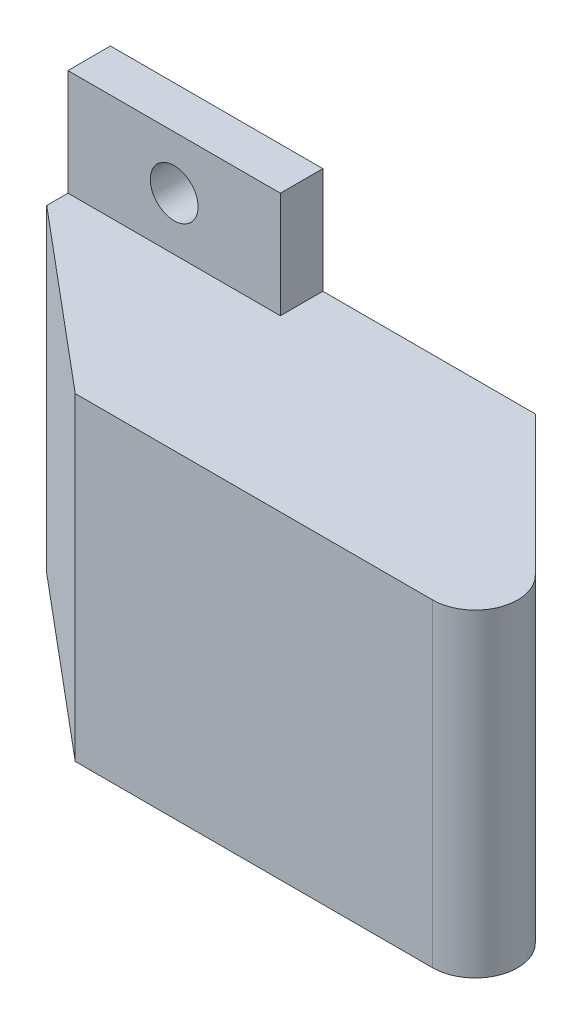
ISO-10303-21;
HEADER;
FILE_DESCRIPTION(('STEP AP214'),'2;1');
FILE_NAME('part.step','',(''),(''),'','','');
FILE_SCHEMA(('AUTOMOTIVE_DESIGN { 1 0 10303 214 1 1 1 1 }'));
ENDSEC;
DATA;
#1=APPLICATION_CONTEXT('core data for automotive mechanical design processes');
#2=APPLICATION_PROTOCOL_DEFINITION('international standard','automotive_design',2000,#1);
#3=PRODUCT_CONTEXT('',#1,'mechanical');
#4=PRODUCT('Part','Part','',(#3));
#5=PRODUCT_RELATED_PRODUCT_CATEGORY('part','',(#4));
#6=PRODUCT_DEFINITION_FORMATION('','',#4);
#7=PRODUCT_DEFINITION_CONTEXT('part definition',#1,'design');
#8=PRODUCT_DEFINITION('design','',#6,#7);
#9=PRODUCT_DEFINITION_SHAPE('','',#8);
#10=(LENGTH_UNIT() NAMED_UNIT(*) SI_UNIT(.MILLI.,.METRE.));
#11=(NAMED_UNIT(*) PLANE_ANGLE_UNIT() SI_UNIT($,.RADIAN.));
#12=(NAMED_UNIT(*) SI_UNIT($,.STERADIAN.) SOLID_ANGLE_UNIT());
#13=UNCERTAINTY_MEASURE_WITH_UNIT(LENGTH_MEASURE(1.E-05),#10,'distance_accuracy_value','');
#14=(GEOMETRIC_REPRESENTATION_CONTEXT(3) GLOBAL_UNCERTAINTY_ASSIGNED_CONTEXT((#13)) GLOBAL_UNIT_ASSIGNED_CONTEXT((#10,
#11,#12)) REPRESENTATION_CONTEXT('',''));
#15=CARTESIAN_POINT('',(0.,0.,0.));
#16=DIRECTION('',(0.,0.,1.));
#17=DIRECTION('',(1.,0.,0.));
#18=AXIS2_PLACEMENT_3D('',#15,#16,#17);
#19=CARTESIAN_POINT('',(60.,0.,0.));
#20=DIRECTION('',(0.,0.,-1.));
#21=DIRECTION('',(-1.,0.,0.));
#22=AXIS2_PLACEMENT_3D('',#19,#20,#21);
#23=PLANE('',#22);
#24=DIRECTION('',(-1.,0.,0.));
#25=VECTOR('',#24,1.);
#26=CARTESIAN_POINT('',(60.,30.,0.));
#27=LINE('',#26,#25);
#28=CARTESIAN_POINT('',(50.3431457505078,30.,0.));
#29=VERTEX_POINT('',#28);
#30=CARTESIAN_POINT('',(16.6845502963189,30.,0.));
#31=VERTEX_POINT('',#30);
#32=EDGE_CURVE('E298',#29,#31,#27,.T.);
#33=ORIENTED_EDGE('',*,*,#32,.T.);
#34=DIRECTION('',(0.,-1.,0.));
#35=VECTOR('',#34,1.);
#36=CARTESIAN_POINT('',(16.6845502963189,0.,0.));
#37=LINE('',#36,#35);
#38=CARTESIAN_POINT('',(16.6845502963189,0.,0.));
#39=VERTEX_POINT('',#38);
#40=EDGE_CURVE('E327',#31,#39,#37,.T.);
#41=ORIENTED_EDGE('',*,*,#40,.T.);
#42=DIRECTION('',(-1.,0.,0.));
#43=VECTOR('',#42,1.);
#44=CARTESIAN_POINT('',(60.,0.,0.));
#45=LINE('',#44,#43);
#46=CARTESIAN_POINT('',(50.3431457505078,0.,0.));
#47=VERTEX_POINT('',#46);
#48=EDGE_CURVE('E308',#47,#39,#45,.T.);
#49=ORIENTED_EDGE('',*,*,#48,.F.);
#50=DIRECTION('',(0.,-1.,0.));
#51=VECTOR('',#50,1.);
#52=CARTESIAN_POINT('',(50.3431457505078,0.,0.));
#53=LINE('',#52,#51);
#54=EDGE_CURVE('E321',#47,#29,#53,.F.);
#55=ORIENTED_EDGE('',*,*,#54,.T.);
#56=EDGE_LOOP('',(#33,#41,#49,#55));
#57=FACE_BOUND('',#56,.T.);
#58=ADVANCED_FACE('F38',(#57),#23,.F.);
#59=CARTESIAN_POINT('',(60.,0.,0.));
#60=DIRECTION('',(0.,1.,0.));
#61=DIRECTION('',(0.,0.,1.));
#62=AXIS2_PLACEMENT_3D('',#59,#60,#61);
#63=PLANE('',#62);
#64=ORIENTED_EDGE('',*,*,#48,.T.);
#65=DIRECTION('',(-0.766044443118977,0.,-0.64278760968654));
#66=VECTOR('',#65,1.);
#67=CARTESIAN_POINT('',(16.6845502963189,0.,0.));
#68=LINE('',#67,#66);
#69=CARTESIAN_POINT('',(0.,0.,-14.));
#70=VERTEX_POINT('',#69);
#71=EDGE_CURVE('E61',#39,#70,#68,.T.);
#72=ORIENTED_EDGE('',*,*,#71,.T.);
#73=DIRECTION('',(0.,0.,-1.));
#74=VECTOR('',#73,1.);
#75=CARTESIAN_POINT('',(0.,0.,0.));
#76=LINE('',#75,#74);
#77=CARTESIAN_POINT('',(0.,0.,-16.));
#78=VERTEX_POINT('',#77);
#79=EDGE_CURVE('E289',#70,#78,#76,.T.);
#80=ORIENTED_EDGE('',*,*,#79,.T.);
#81=DIRECTION('',(1.,0.,0.));
#82=VECTOR('',#81,1.);
#83=CARTESIAN_POINT('',(60.,0.,-16.));
#84=LINE('',#83,#82);
#85=CARTESIAN_POINT('',(20.,0.,-16.));
#86=VERTEX_POINT('',#85);
#87=EDGE_CURVE('E281',#78,#86,#84,.T.);
#88=ORIENTED_EDGE('',*,*,#87,.T.);
#89=DIRECTION('',(0.,0.,-1.));
#90=VECTOR('',#89,1.);
#91=CARTESIAN_POINT('',(20.,0.,0.));
#92=LINE('',#91,#90);
#93=CARTESIAN_POINT('',(20.,0.,-20.));
#94=VERTEX_POINT('',#93);
#95=EDGE_CURVE('E285',#86,#94,#92,.T.);
#96=ORIENTED_EDGE('',*,*,#95,.T.);
#97=DIRECTION('',(-1.,0.,0.));
#98=VECTOR('',#97,1.);
#99=CARTESIAN_POINT('',(60.,0.,-20.));
#100=LINE('',#99,#98);
#101=CARTESIAN_POINT('',(40.,0.,-20.));
#102=VERTEX_POINT('',#101);
#103=EDGE_CURVE('E305',#102,#94,#100,.T.);
#104=ORIENTED_EDGE('',*,*,#103,.F.);
#105=DIRECTION('',(0.707106781186551,0.,0.707106781186544));
#106=VECTOR('',#105,1.);
#107=CARTESIAN_POINT('',(60.,0.,0.));
#108=LINE('',#107,#106);
#109=CARTESIAN_POINT('',(53.1715728752538,0.,-6.82842712474609));
#110=VERTEX_POINT('',#109);
#111=EDGE_CURVE('E212',#102,#110,#108,.T.);
#112=ORIENTED_EDGE('',*,*,#111,.T.);
#113=CARTESIAN_POINT('',(50.3431457505078,0.,-4.));
#114=DIRECTION('',(0.,1.,0.));
#115=DIRECTION('',(0.,0.,1.));
#116=AXIS2_PLACEMENT_3D('',#113,#114,#115);
#117=CIRCLE('',#116,4.);
#118=EDGE_CURVE('E318',#110,#47,#117,.F.);
#119=ORIENTED_EDGE('',*,*,#118,.T.);
#120=EDGE_LOOP('',(#64,#72,#80,#88,#96,#104,#112,#119));
#121=FACE_BOUND('',#120,.T.);
#122=ADVANCED_FACE('F356',(#121),#63,.F.);
#123=CARTESIAN_POINT('',(60.,0.,-20.));
#124=DIRECTION('',(0.,0.,1.));
#125=DIRECTION('',(1.,0.,0.));
#126=AXIS2_PLACEMENT_3D('',#123,#124,#125);
#127=PLANE('',#126);
#128=DIRECTION('',(-1.,0.,0.));
#129=VECTOR('',#128,1.);
#130=CARTESIAN_POINT('',(60.,30.,-20.));
#131=LINE('',#130,#129);
#132=CARTESIAN_POINT('',(40.,30.,-20.));
#133=VERTEX_POINT('',#132);
#134=CARTESIAN_POINT('',(20.,30.,-20.));
#135=VERTEX_POINT('',#134);
#136=EDGE_CURVE('E302',#133,#135,#131,.T.);
#137=ORIENTED_EDGE('',*,*,#136,.F.);
#138=DIRECTION('',(0.,1.,0.));
#139=VECTOR('',#138,1.);
#140=CARTESIAN_POINT('',(40.,-10.,-20.));
#141=LINE('',#140,#139);
#142=EDGE_CURVE('E209',#102,#133,#141,.T.);
#143=ORIENTED_EDGE('',*,*,#142,.F.);
#144=ORIENTED_EDGE('',*,*,#103,.T.);
#145=DIRECTION('',(0.,-1.,0.));
#146=VECTOR('',#145,1.);
#147=CARTESIAN_POINT('',(20.,40.,-20.));
#148=LINE('',#147,#146);
#149=CARTESIAN_POINT('',(20.,-10.,-20.));
#150=VERTEX_POINT('',#149);
#151=EDGE_CURVE('E255',#94,#150,#148,.T.);
#152=ORIENTED_EDGE('',*,*,#151,.T.);
#153=DIRECTION('',(-1.,0.,0.));
#154=VECTOR('',#153,1.);
#155=CARTESIAN_POINT('',(0.,-10.,-20.));
#156=LINE('',#155,#154);
#157=CARTESIAN_POINT('',(0.,-10.,-20.));
#158=VERTEX_POINT('',#157);
#159=EDGE_CURVE('E260',#150,#158,#156,.T.);
#160=ORIENTED_EDGE('',*,*,#159,.T.);
#161=DIRECTION('',(0.,1.,0.));
#162=VECTOR('',#161,1.);
#163=CARTESIAN_POINT('',(0.,0.,-20.));
#164=LINE('',#163,#162);
#165=CARTESIAN_POINT('',(0.,40.,-20.));
#166=VERTEX_POINT('',#165);
#167=EDGE_CURVE('E292',#158,#166,#164,.T.);
#168=ORIENTED_EDGE('',*,*,#167,.T.);
#169=DIRECTION('',(1.,0.,0.));
#170=VECTOR('',#169,1.);
#171=CARTESIAN_POINT('',(0.,40.,-20.));
#172=LINE('',#171,#170);
#173=CARTESIAN_POINT('',(20.,40.,-20.));
#174=VERTEX_POINT('',#173);
#175=EDGE_CURVE('E229',#166,#174,#172,.T.);
#176=ORIENTED_EDGE('',*,*,#175,.T.);
#177=EDGE_CURVE('E256',#174,#135,#148,.T.);
#178=ORIENTED_EDGE('',*,*,#177,.T.);
#179=EDGE_LOOP('',(#137,#143,#144,#152,#160,#168,#176,#178));
#180=FACE_BOUND('',#179,.T.);
#181=CARTESIAN_POINT('',(10.,35.,-20.));
#182=DIRECTION('',(0.,0.,-1.));
#183=DIRECTION('',(-1.,0.,0.));
#184=AXIS2_PLACEMENT_3D('',#181,#182,#183);
#185=CIRCLE('',#184,2.25);
#186=CARTESIAN_POINT('',(7.75,35.,-20.));
#187=VERTEX_POINT('',#186);
#188=EDGE_CURVE('E221',#187,#187,#185,.T.);
#189=ORIENTED_EDGE('',*,*,#188,.F.);
#190=EDGE_LOOP('',(#189));
#191=FACE_BOUND('',#190,.T.);
#192=CARTESIAN_POINT('',(9.99999999999999,-5.,-20.));
#193=DIRECTION('',(0.,0.,-1.));
#194=DIRECTION('',(-1.,0.,0.));
#195=AXIS2_PLACEMENT_3D('',#192,#193,#194);
#196=CIRCLE('',#195,2.25);
#197=CARTESIAN_POINT('',(7.74999999999999,-5.,-20.));
#198=VERTEX_POINT('',#197);
#199=EDGE_CURVE('E216',#198,#198,#196,.T.);
#200=ORIENTED_EDGE('',*,*,#199,.F.);
#201=EDGE_LOOP('',(#200));
#202=FACE_BOUND('',#201,.T.);
#203=ADVANCED_FACE('F339',(#180,#191,#202),#127,.F.);
#204=CARTESIAN_POINT('',(60.,30.,0.));
#205=DIRECTION('',(0.,-1.,0.));
#206=DIRECTION('',(0.,0.,-1.));
#207=AXIS2_PLACEMENT_3D('',#204,#205,#206);
#208=PLANE('',#207);
#209=DIRECTION('',(0.,0.,1.));
#210=VECTOR('',#209,1.);
#211=CARTESIAN_POINT('',(0.,30.,0.));
#212=LINE('',#211,#210);
#213=CARTESIAN_POINT('',(0.,30.,-16.));
#214=VERTEX_POINT('',#213);
#215=CARTESIAN_POINT('',(0.,30.,-14.));
#216=VERTEX_POINT('',#215);
#217=EDGE_CURVE('E295',#214,#216,#212,.T.);
#218=ORIENTED_EDGE('',*,*,#217,.T.);
#219=DIRECTION('',(0.766044443118977,0.,0.64278760968654));
#220=VECTOR('',#219,1.);
#221=CARTESIAN_POINT('',(16.6845502963189,30.,0.));
#222=LINE('',#221,#220);
#223=EDGE_CURVE('E11',#216,#31,#222,.T.);
#224=ORIENTED_EDGE('',*,*,#223,.T.);
#225=ORIENTED_EDGE('',*,*,#32,.F.);
#226=CARTESIAN_POINT('',(50.3431457505078,30.,-4.));
#227=DIRECTION('',(0.,-1.,0.));
#228=DIRECTION('',(0.,0.,-1.));
#229=AXIS2_PLACEMENT_3D('',#226,#227,#228);
#230=CIRCLE('',#229,4.);
#231=CARTESIAN_POINT('',(53.1715728752539,30.,-6.8284271247462));
#232=VERTEX_POINT('',#231);
#233=EDGE_CURVE('E324',#29,#232,#230,.F.);
#234=ORIENTED_EDGE('',*,*,#233,.T.);
#235=DIRECTION('',(0.707106781186551,0.,0.707106781186544));
#236=VECTOR('',#235,1.);
#237=CARTESIAN_POINT('',(40.,30.,-20.));
#238=LINE('',#237,#236);
#239=EDGE_CURVE('E200',#133,#232,#238,.T.);
#240=ORIENTED_EDGE('',*,*,#239,.F.);
#241=ORIENTED_EDGE('',*,*,#136,.T.);
#242=DIRECTION('',(0.,0.,1.));
#243=VECTOR('',#242,1.);
#244=CARTESIAN_POINT('',(20.,30.,0.));
#245=LINE('',#244,#243);
#246=CARTESIAN_POINT('',(20.,30.,-16.));
#247=VERTEX_POINT('',#246);
#248=EDGE_CURVE('E311',#135,#247,#245,.T.);
#249=ORIENTED_EDGE('',*,*,#248,.T.);
#250=DIRECTION('',(-1.,0.,0.));
#251=VECTOR('',#250,1.);
#252=CARTESIAN_POINT('',(60.,30.,-16.));
#253=LINE('',#252,#251);
#254=EDGE_CURVE('E268',#247,#214,#253,.T.);
#255=ORIENTED_EDGE('',*,*,#254,.T.);
#256=EDGE_LOOP('',(#218,#224,#225,#234,#240,#241,#249,#255));
#257=FACE_BOUND('',#256,.T.);
#258=ADVANCED_FACE('F362',(#257),#208,.F.);
#259=CARTESIAN_POINT('',(0.,0.,0.));
#260=DIRECTION('',(-1.,0.,0.));
#261=DIRECTION('',(0.,0.,1.));
#262=AXIS2_PLACEMENT_3D('',#259,#260,#261);
#263=PLANE('',#262);
#264=ORIENTED_EDGE('',*,*,#79,.F.);
#265=DIRECTION('',(0.,1.,0.));
#266=VECTOR('',#265,1.);
#267=CARTESIAN_POINT('',(0.,30.,-14.));
#268=LINE('',#267,#266);
#269=EDGE_CURVE('E47',#70,#216,#268,.T.);
#270=ORIENTED_EDGE('',*,*,#269,.T.);
#271=ORIENTED_EDGE('',*,*,#217,.F.);
#272=DIRECTION('',(0.,1.,0.));
#273=VECTOR('',#272,1.);
#274=CARTESIAN_POINT('',(0.,40.,-16.));
#275=LINE('',#274,#273);
#276=CARTESIAN_POINT('',(0.,40.,-16.));
#277=VERTEX_POINT('',#276);
#278=EDGE_CURVE('E238',#214,#277,#275,.T.);
#279=ORIENTED_EDGE('',*,*,#278,.T.);
#280=DIRECTION('',(0.,0.,-1.));
#281=VECTOR('',#280,1.);
#282=CARTESIAN_POINT('',(0.,40.,-16.));
#283=LINE('',#282,#281);
#284=EDGE_CURVE('E251',#277,#166,#283,.T.);
#285=ORIENTED_EDGE('',*,*,#284,.T.);
#286=ORIENTED_EDGE('',*,*,#167,.F.);
#287=DIRECTION('',(0.,0.,-1.));
#288=VECTOR('',#287,1.);
#289=CARTESIAN_POINT('',(0.,-10.,-16.));
#290=LINE('',#289,#288);
#291=CARTESIAN_POINT('',(0.,-10.,-16.));
#292=VERTEX_POINT('',#291);
#293=EDGE_CURVE('E264',#292,#158,#290,.T.);
#294=ORIENTED_EDGE('',*,*,#293,.F.);
#295=EDGE_CURVE('E233',#292,#78,#275,.T.);
#296=ORIENTED_EDGE('',*,*,#295,.T.);
#297=EDGE_LOOP('',(#264,#270,#271,#279,#285,#286,#294,#296));
#298=FACE_BOUND('',#297,.T.);
#299=ADVANCED_FACE('F352',(#298),#263,.T.);
#300=CARTESIAN_POINT('',(0.,40.,-16.));
#301=DIRECTION('',(0.,1.,0.));
#302=DIRECTION('',(0.,0.,1.));
#303=AXIS2_PLACEMENT_3D('',#300,#301,#302);
#304=PLANE('',#303);
#305=ORIENTED_EDGE('',*,*,#175,.F.);
#306=ORIENTED_EDGE('',*,*,#284,.F.);
#307=DIRECTION('',(1.,0.,0.));
#308=VECTOR('',#307,1.);
#309=CARTESIAN_POINT('',(0.,40.,-16.));
#310=LINE('',#309,#308);
#311=CARTESIAN_POINT('',(20.,40.,-16.));
#312=VERTEX_POINT('',#311);
#313=EDGE_CURVE('E237',#277,#312,#310,.T.);
#314=ORIENTED_EDGE('',*,*,#313,.T.);
#315=DIRECTION('',(0.,0.,-1.));
#316=VECTOR('',#315,1.);
#317=CARTESIAN_POINT('',(20.,40.,-16.));
#318=LINE('',#317,#316);
#319=EDGE_CURVE('E273',#312,#174,#318,.T.);
#320=ORIENTED_EDGE('',*,*,#319,.T.);
#321=EDGE_LOOP('',(#305,#306,#314,#320));
#322=FACE_BOUND('',#321,.T.);
#323=ADVANCED_FACE('F386',(#322),#304,.T.);
#324=CARTESIAN_POINT('',(10.,35.,-16.));
#325=DIRECTION('',(0.,0.,-1.));
#326=DIRECTION('',(-1.,0.,0.));
#327=AXIS2_PLACEMENT_3D('',#324,#325,#326);
#328=CYLINDRICAL_SURFACE('',#327,2.25);
#329=CARTESIAN_POINT('',(10.,35.,-16.));
#330=DIRECTION('',(0.,0.,-1.));
#331=DIRECTION('',(-1.,0.,0.));
#332=AXIS2_PLACEMENT_3D('',#329,#330,#331);
#333=CIRCLE('',#332,2.25);
#334=CARTESIAN_POINT('',(7.75,35.,-16.));
#335=VERTEX_POINT('',#334);
#336=EDGE_CURVE('E225',#335,#335,#333,.T.);
#337=ORIENTED_EDGE('',*,*,#336,.F.);
#338=EDGE_LOOP('',(#337));
#339=FACE_BOUND('',#338,.T.);
#340=ORIENTED_EDGE('',*,*,#188,.T.);
#341=EDGE_LOOP('',(#340));
#342=FACE_BOUND('',#341,.T.);
#343=ADVANCED_FACE('F388',(#339,#342),#328,.F.);
#344=CARTESIAN_POINT('',(0.,0.,-16.));
#345=DIRECTION('',(0.,0.,1.));
#346=DIRECTION('',(1.,0.,0.));
#347=AXIS2_PLACEMENT_3D('',#344,#345,#346);
#348=PLANE('',#347);
#349=ORIENTED_EDGE('',*,*,#336,.T.);
#350=EDGE_LOOP('',(#349));
#351=FACE_BOUND('',#350,.T.);
#352=ORIENTED_EDGE('',*,*,#254,.F.);
#353=DIRECTION('',(0.,-1.,0.));
#354=VECTOR('',#353,1.);
#355=CARTESIAN_POINT('',(20.,40.,-16.));
#356=LINE('',#355,#354);
#357=EDGE_CURVE('E243',#312,#247,#356,.T.);
#358=ORIENTED_EDGE('',*,*,#357,.F.);
#359=ORIENTED_EDGE('',*,*,#313,.F.);
#360=ORIENTED_EDGE('',*,*,#278,.F.);
#361=EDGE_LOOP('',(#352,#358,#359,#360));
#362=FACE_BOUND('',#361,.T.);
#363=ADVANCED_FACE('F381',(#351,#362),#348,.T.);
#364=CARTESIAN_POINT('',(20.,40.,-16.));
#365=DIRECTION('',(1.,0.,0.));
#366=DIRECTION('',(0.,1.,0.));
#367=AXIS2_PLACEMENT_3D('',#364,#365,#366);
#368=PLANE('',#367);
#369=ORIENTED_EDGE('',*,*,#248,.F.);
#370=ORIENTED_EDGE('',*,*,#177,.F.);
#371=ORIENTED_EDGE('',*,*,#319,.F.);
#372=ORIENTED_EDGE('',*,*,#357,.T.);
#373=EDGE_LOOP('',(#369,#370,#371,#372));
#374=FACE_BOUND('',#373,.T.);
#375=ADVANCED_FACE('F377',(#374),#368,.T.);
#376=ORIENTED_EDGE('',*,*,#95,.F.);
#377=CARTESIAN_POINT('',(20.,-10.,-16.));
#378=VERTEX_POINT('',#377);
#379=EDGE_CURVE('E242',#86,#378,#356,.T.);
#380=ORIENTED_EDGE('',*,*,#379,.T.);
#381=DIRECTION('',(0.,0.,-1.));
#382=VECTOR('',#381,1.);
#383=CARTESIAN_POINT('',(20.,-10.,-16.));
#384=LINE('',#383,#382);
#385=EDGE_CURVE('E269',#378,#150,#384,.T.);
#386=ORIENTED_EDGE('',*,*,#385,.T.);
#387=ORIENTED_EDGE('',*,*,#151,.F.);
#388=EDGE_LOOP('',(#376,#380,#386,#387));
#389=FACE_BOUND('',#388,.T.);
#390=ADVANCED_FACE('F346',(#389),#368,.T.);
#391=CARTESIAN_POINT('',(9.99999999999999,-5.,-16.));
#392=DIRECTION('',(0.,0.,-1.));
#393=DIRECTION('',(-1.,0.,0.));
#394=AXIS2_PLACEMENT_3D('',#391,#392,#393);
#395=CIRCLE('',#394,2.25);
#396=CARTESIAN_POINT('',(7.74999999999999,-5.,-16.));
#397=VERTEX_POINT('',#396);
#398=EDGE_CURVE('E217',#397,#397,#395,.T.);
#399=ORIENTED_EDGE('',*,*,#398,.T.);
#400=EDGE_LOOP('',(#399));
#401=FACE_BOUND('',#400,.T.);
#402=ORIENTED_EDGE('',*,*,#87,.F.);
#403=ORIENTED_EDGE('',*,*,#295,.F.);
#404=DIRECTION('',(-1.,0.,0.));
#405=VECTOR('',#404,1.);
#406=CARTESIAN_POINT('',(0.,-10.,-16.));
#407=LINE('',#406,#405);
#408=EDGE_CURVE('E247',#378,#292,#407,.T.);
#409=ORIENTED_EDGE('',*,*,#408,.F.);
#410=ORIENTED_EDGE('',*,*,#379,.F.);
#411=EDGE_LOOP('',(#402,#403,#409,#410));
#412=FACE_BOUND('',#411,.T.);
#413=ADVANCED_FACE('F355',(#401,#412),#348,.T.);
#414=CARTESIAN_POINT('',(0.,-10.,-16.));
#415=DIRECTION('',(0.,-1.,0.));
#416=DIRECTION('',(0.,0.,-1.));
#417=AXIS2_PLACEMENT_3D('',#414,#415,#416);
#418=PLANE('',#417);
#419=ORIENTED_EDGE('',*,*,#159,.F.);
#420=ORIENTED_EDGE('',*,*,#385,.F.);
#421=ORIENTED_EDGE('',*,*,#408,.T.);
#422=ORIENTED_EDGE('',*,*,#293,.T.);
#423=EDGE_LOOP('',(#419,#420,#421,#422));
#424=FACE_BOUND('',#423,.T.);
#425=ADVANCED_FACE('F350',(#424),#418,.T.);
#426=CARTESIAN_POINT('',(9.99999999999999,-5.,-16.));
#427=DIRECTION('',(0.,0.,-1.));
#428=DIRECTION('',(-1.,0.,0.));
#429=AXIS2_PLACEMENT_3D('',#426,#427,#428);
#430=CYLINDRICAL_SURFACE('',#429,2.25);
#431=ORIENTED_EDGE('',*,*,#398,.F.);
#432=EDGE_LOOP('',(#431));
#433=FACE_BOUND('',#432,.T.);
#434=ORIENTED_EDGE('',*,*,#199,.T.);
#435=EDGE_LOOP('',(#434));
#436=FACE_BOUND('',#435,.T.);
#437=ADVANCED_FACE('F415',(#433,#436),#430,.F.);
#438=CARTESIAN_POINT('',(40.,-10.,-20.));
#439=DIRECTION('',(-0.707106781186544,0.,0.707106781186551));
#440=DIRECTION('',(0.707106781186551,0.,0.707106781186544));
#441=AXIS2_PLACEMENT_3D('',#438,#439,#440);
#442=PLANE('',#441);
#443=DIRECTION('',(0.707106781186551,0.,0.707106781186544));
#444=VECTOR('',#443,1.);
#445=CARTESIAN_POINT('',(44.9497474683059,25.,-15.0502525316942));
#446=LINE('',#445,#444);
#447=CARTESIAN_POINT('',(44.9497474683059,25.,-15.0502525316942));
#448=VERTEX_POINT('',#447);
#449=CARTESIAN_POINT('',(52.0208152801714,25.,-7.97918471982876));
#450=VERTEX_POINT('',#449);
#451=EDGE_CURVE('E191',#448,#450,#446,.T.);
#452=ORIENTED_EDGE('',*,*,#451,.F.);
#453=DIRECTION('',(0.,1.,0.));
#454=VECTOR('',#453,1.);
#455=CARTESIAN_POINT('',(44.9497474683059,25.,-15.0502525316942));
#456=LINE('',#455,#454);
#457=CARTESIAN_POINT('',(44.9497474683059,5.,-15.0502525316942));
#458=VERTEX_POINT('',#457);
#459=EDGE_CURVE('E158',#458,#448,#456,.T.);
#460=ORIENTED_EDGE('',*,*,#459,.F.);
#461=DIRECTION('',(-0.707106781186551,0.,-0.707106781186544));
#462=VECTOR('',#461,1.);
#463=CARTESIAN_POINT('',(44.9497474683059,5.,-15.0502525316942));
#464=LINE('',#463,#462);
#465=CARTESIAN_POINT('',(52.0208152801714,4.99999999999999,-7.97918471982876));
#466=VERTEX_POINT('',#465);
#467=EDGE_CURVE('E178',#466,#458,#464,.T.);
#468=ORIENTED_EDGE('',*,*,#467,.F.);
#469=DIRECTION('',(0.,-1.,0.));
#470=VECTOR('',#469,1.);
#471=CARTESIAN_POINT('',(52.0208152801714,25.,-7.97918471982876));
#472=LINE('',#471,#470);
#473=EDGE_CURVE('E182',#450,#466,#472,.T.);
#474=ORIENTED_EDGE('',*,*,#473,.F.);
#475=EDGE_LOOP('',(#452,#460,#468,#474));
#476=FACE_BOUND('',#475,.T.);
#477=ORIENTED_EDGE('',*,*,#239,.T.);
#478=DIRECTION('',(0.,-1.,0.));
#479=VECTOR('',#478,1.);
#480=CARTESIAN_POINT('',(53.1715728752539,-10.,-6.8284271247462));
#481=LINE('',#480,#479);
#482=EDGE_CURVE('E314',#232,#110,#481,.T.);
#483=ORIENTED_EDGE('',*,*,#482,.T.);
#484=ORIENTED_EDGE('',*,*,#111,.F.);
#485=ORIENTED_EDGE('',*,*,#142,.T.);
#486=EDGE_LOOP('',(#477,#483,#484,#485));
#487=FACE_BOUND('',#486,.T.);
#488=ADVANCED_FACE('F372',(#476,#487),#442,.F.);
#489=CARTESIAN_POINT('',(50.3431457505078,-10.,-4.));
#490=DIRECTION('',(0.,-1.,0.));
#491=DIRECTION('',(0.,0.,-1.));
#492=AXIS2_PLACEMENT_3D('',#489,#490,#491);
#493=CYLINDRICAL_SURFACE('',#492,4.);
#494=ORIENTED_EDGE('',*,*,#233,.F.);
#495=ORIENTED_EDGE('',*,*,#54,.F.);
#496=ORIENTED_EDGE('',*,*,#118,.F.);
#497=ORIENTED_EDGE('',*,*,#482,.F.);
#498=EDGE_LOOP('',(#494,#495,#496,#497));
#499=FACE_BOUND('',#498,.T.);
#500=ADVANCED_FACE('F368',(#499),#493,.T.);
#501=CARTESIAN_POINT('',(41.4142135623732,25.,-11.5147186257614));
#502=DIRECTION('',(-0.707106781186551,0.,-0.707106781186544));
#503=DIRECTION('',(-0.707106781186544,0.,0.707106781186551));
#504=AXIS2_PLACEMENT_3D('',#501,#502,#503);
#505=PLANE('',#504);
#506=ORIENTED_EDGE('',*,*,#459,.T.);
#507=DIRECTION('',(0.707106781186544,0.,-0.707106781186551));
#508=VECTOR('',#507,1.);
#509=CARTESIAN_POINT('',(41.4142135623732,25.,-11.5147186257614));
#510=LINE('',#509,#508);
#511=CARTESIAN_POINT('',(41.4142135623732,25.,-11.5147186257614));
#512=VERTEX_POINT('',#511);
#513=EDGE_CURVE('E151',#512,#448,#510,.T.);
#514=ORIENTED_EDGE('',*,*,#513,.F.);
#515=DIRECTION('',(0.,1.,0.));
#516=VECTOR('',#515,1.);
#517=CARTESIAN_POINT('',(41.4142135623732,25.,-11.5147186257614));
#518=LINE('',#517,#516);
#519=CARTESIAN_POINT('',(41.4142135623732,5.,-11.5147186257614));
#520=VERTEX_POINT('',#519);
#521=EDGE_CURVE('E155',#520,#512,#518,.T.);
#522=ORIENTED_EDGE('',*,*,#521,.F.);
#523=DIRECTION('',(0.707106781186544,0.,-0.707106781186551));
#524=VECTOR('',#523,1.);
#525=CARTESIAN_POINT('',(41.4142135623732,5.,-11.5147186257614));
#526=LINE('',#525,#524);
#527=EDGE_CURVE('E197',#520,#458,#526,.T.);
#528=ORIENTED_EDGE('',*,*,#527,.T.);
#529=EDGE_LOOP('',(#506,#514,#522,#528));
#530=FACE_BOUND('',#529,.T.);
#531=ADVANCED_FACE('F153',(#530),#505,.F.);
#532=CARTESIAN_POINT('',(41.4142135623732,5.,-11.5147186257614));
#533=DIRECTION('',(0.,-1.,0.));
#534=DIRECTION('',(1.,0.,0.));
#535=AXIS2_PLACEMENT_3D('',#532,#533,#534);
#536=PLANE('',#535);
#537=ORIENTED_EDGE('',*,*,#467,.T.);
#538=ORIENTED_EDGE('',*,*,#527,.F.);
#539=DIRECTION('',(-0.707106781186551,0.,-0.707106781186544));
#540=VECTOR('',#539,1.);
#541=CARTESIAN_POINT('',(41.4142135623732,5.,-11.5147186257614));
#542=LINE('',#541,#540);
#543=CARTESIAN_POINT('',(48.4852813742387,4.99999999999999,-4.44365081389601));
#544=VERTEX_POINT('',#543);
#545=EDGE_CURVE('E164',#544,#520,#542,.T.);
#546=ORIENTED_EDGE('',*,*,#545,.F.);
#547=DIRECTION('',(0.707106781186544,0.,-0.707106781186551));
#548=VECTOR('',#547,1.);
#549=CARTESIAN_POINT('',(48.4852813742387,4.99999999999999,-4.44365081389601));
#550=LINE('',#549,#548);
#551=EDGE_CURVE('E201',#544,#466,#550,.T.);
#552=ORIENTED_EDGE('',*,*,#551,.T.);
#553=EDGE_LOOP('',(#537,#538,#546,#552));
#554=FACE_BOUND('',#553,.T.);
#555=ADVANCED_FACE('F412',(#554),#536,.F.);
#556=CARTESIAN_POINT('',(48.4852813742387,25.,-4.44365081389601));
#557=DIRECTION('',(0.707106781186551,0.,0.707106781186544));
#558=DIRECTION('',(0.707106781186544,0.,-0.707106781186551));
#559=AXIS2_PLACEMENT_3D('',#556,#557,#558);
#560=PLANE('',#559);
#561=ORIENTED_EDGE('',*,*,#473,.T.);
#562=ORIENTED_EDGE('',*,*,#551,.F.);
#563=DIRECTION('',(0.,-1.,0.));
#564=VECTOR('',#563,1.);
#565=CARTESIAN_POINT('',(48.4852813742387,25.,-4.44365081389601));
#566=LINE('',#565,#564);
#567=CARTESIAN_POINT('',(48.4852813742387,25.,-4.44365081389601));
#568=VERTEX_POINT('',#567);
#569=EDGE_CURVE('E173',#568,#544,#566,.T.);
#570=ORIENTED_EDGE('',*,*,#569,.F.);
#571=DIRECTION('',(0.707106781186544,0.,-0.707106781186551));
#572=VECTOR('',#571,1.);
#573=CARTESIAN_POINT('',(48.4852813742387,25.,-4.44365081389601));
#574=LINE('',#573,#572);
#575=EDGE_CURVE('E163',#568,#450,#574,.T.);
#576=ORIENTED_EDGE('',*,*,#575,.T.);
#577=EDGE_LOOP('',(#561,#562,#570,#576));
#578=FACE_BOUND('',#577,.T.);
#579=ADVANCED_FACE('F475',(#578),#560,.F.);
#580=CARTESIAN_POINT('',(41.4142135623732,25.,-11.5147186257614));
#581=DIRECTION('',(0.,1.,0.));
#582=DIRECTION('',(-1.,0.,0.));
#583=AXIS2_PLACEMENT_3D('',#580,#581,#582);
#584=PLANE('',#583);
#585=ORIENTED_EDGE('',*,*,#451,.T.);
#586=ORIENTED_EDGE('',*,*,#575,.F.);
#587=DIRECTION('',(0.707106781186551,0.,0.707106781186544));
#588=VECTOR('',#587,1.);
#589=CARTESIAN_POINT('',(41.4142135623732,25.,-11.5147186257614));
#590=LINE('',#589,#588);
#591=EDGE_CURVE('E167',#512,#568,#590,.T.);
#592=ORIENTED_EDGE('',*,*,#591,.F.);
#593=ORIENTED_EDGE('',*,*,#513,.T.);
#594=EDGE_LOOP('',(#585,#586,#592,#593));
#595=FACE_BOUND('',#594,.T.);
#596=ADVANCED_FACE('F168',(#595),#584,.F.);
#597=CARTESIAN_POINT('',(26.4644660940671,0.,-26.4644660940674));
#598=DIRECTION('',(-0.707106781186544,0.,0.707106781186551));
#599=DIRECTION('',(0.707106781186551,0.,0.707106781186544));
#600=AXIS2_PLACEMENT_3D('',#597,#598,#599);
#601=PLANE('',#600);
#602=ORIENTED_EDGE('',*,*,#521,.T.);
#603=ORIENTED_EDGE('',*,*,#591,.T.);
#604=ORIENTED_EDGE('',*,*,#569,.T.);
#605=ORIENTED_EDGE('',*,*,#545,.T.);
#606=EDGE_LOOP('',(#602,#603,#604,#605));
#607=FACE_BOUND('',#606,.T.);
#608=ADVANCED_FACE('F175',(#607),#601,.F.);
#609=CARTESIAN_POINT('',(16.6845502963189,0.,0.));
#610=DIRECTION('',(-0.64278760968654,0.,0.766044443118977));
#611=DIRECTION('',(0.,1.,0.));
#612=AXIS2_PLACEMENT_3D('',#609,#610,#611);
#613=PLANE('',#612);
#614=ORIENTED_EDGE('',*,*,#223,.F.);
#615=ORIENTED_EDGE('',*,*,#269,.F.);
#616=ORIENTED_EDGE('',*,*,#71,.F.);
#617=ORIENTED_EDGE('',*,*,#40,.F.);
#618=EDGE_LOOP('',(#614,#615,#616,#617));
#619=FACE_BOUND('',#618,.T.);
#620=ADVANCED_FACE('F40',(#619),#613,.T.);
#621=CLOSED_SHELL('',(#58,#122,#203,#258,#299,#323,#343,#363,#375,#390,#413,#425,#437,#488,#500,
#531,#555,#579,#596,#608,#620));
#622=MANIFOLD_SOLID_BREP('B2',#621);
#623=ADVANCED_BREP_SHAPE_REPRESENTATION('',(#18,#622),#14);
#624=SHAPE_DEFINITION_REPRESENTATION(#9,#623);
ENDSEC;
END-ISO-10303-21;
